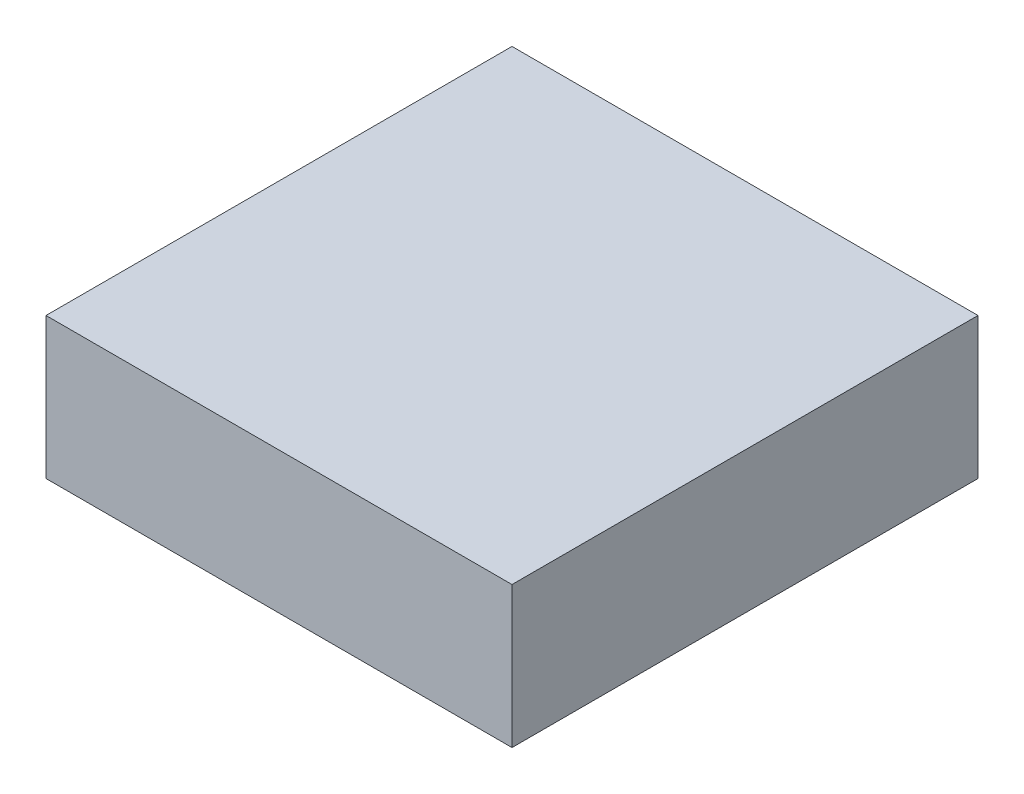
ISO-10303-21;
HEADER;
FILE_DESCRIPTION(('STEP AP214'),'2;1');
FILE_NAME('part.step','',(''),(''),'','','');
FILE_SCHEMA(('AUTOMOTIVE_DESIGN { 1 0 10303 214 1 1 1 1 }'));
ENDSEC;
DATA;
#1=APPLICATION_CONTEXT('core data for automotive mechanical design processes');
#2=APPLICATION_PROTOCOL_DEFINITION('international standard','automotive_design',2000,#1);
#3=PRODUCT_CONTEXT('',#1,'mechanical');
#4=PRODUCT('Part','Part','',(#3));
#5=PRODUCT_RELATED_PRODUCT_CATEGORY('part','',(#4));
#6=PRODUCT_DEFINITION_FORMATION('','',#4);
#7=PRODUCT_DEFINITION_CONTEXT('part definition',#1,'design');
#8=PRODUCT_DEFINITION('design','',#6,#7);
#9=PRODUCT_DEFINITION_SHAPE('','',#8);
#10=(LENGTH_UNIT() NAMED_UNIT(*) SI_UNIT(.MILLI.,.METRE.));
#11=(NAMED_UNIT(*) PLANE_ANGLE_UNIT() SI_UNIT($,.RADIAN.));
#12=(NAMED_UNIT(*) SI_UNIT($,.STERADIAN.) SOLID_ANGLE_UNIT());
#13=UNCERTAINTY_MEASURE_WITH_UNIT(LENGTH_MEASURE(1.E-05),#10,'distance_accuracy_value','');
#14=(GEOMETRIC_REPRESENTATION_CONTEXT(3) GLOBAL_UNCERTAINTY_ASSIGNED_CONTEXT((#13)) GLOBAL_UNIT_ASSIGNED_CONTEXT((#10,
#11,#12)) REPRESENTATION_CONTEXT('',''));
#15=CARTESIAN_POINT('',(0.,0.,0.));
#16=DIRECTION('',(0.,0.,1.));
#17=DIRECTION('',(1.,0.,0.));
#18=AXIS2_PLACEMENT_3D('',#15,#16,#17);
#19=CARTESIAN_POINT('',(27.35,-1.85,-11.525));
#20=DIRECTION('',(0.,-1.,0.));
#21=DIRECTION('',(1.,0.,0.));
#22=AXIS2_PLACEMENT_3D('',#19,#20,#21);
#23=PLANE('',#22);
#24=DIRECTION('',(1.,0.,0.));
#25=VECTOR('',#24,1.);
#26=CARTESIAN_POINT('',(29.,-1.85,-8.225));
#27=LINE('',#26,#25);
#28=CARTESIAN_POINT('',(27.35,-1.85,-8.225));
#29=VERTEX_POINT('',#28);
#30=CARTESIAN_POINT('',(30.65,-1.85,-8.225));
#31=VERTEX_POINT('',#30);
#32=EDGE_CURVE('E54',#29,#31,#27,.T.);
#33=ORIENTED_EDGE('',*,*,#32,.F.);
#34=DIRECTION('',(0.,0.,1.));
#35=VECTOR('',#34,1.);
#36=CARTESIAN_POINT('',(27.35,-1.85,-9.875));
#37=LINE('',#36,#35);
#38=CARTESIAN_POINT('',(27.35,-1.85,-11.525));
#39=VERTEX_POINT('',#38);
#40=EDGE_CURVE('E69',#39,#29,#37,.T.);
#41=ORIENTED_EDGE('',*,*,#40,.F.);
#42=DIRECTION('',(-1.,0.,0.));
#43=VECTOR('',#42,1.);
#44=CARTESIAN_POINT('',(29.,-1.85,-11.525));
#45=LINE('',#44,#43);
#46=CARTESIAN_POINT('',(30.65,-1.85,-11.525));
#47=VERTEX_POINT('',#46);
#48=EDGE_CURVE('E21',#47,#39,#45,.T.);
#49=ORIENTED_EDGE('',*,*,#48,.F.);
#50=DIRECTION('',(0.,0.,-1.));
#51=VECTOR('',#50,1.);
#52=CARTESIAN_POINT('',(30.65,-1.85,-9.875));
#53=LINE('',#52,#51);
#54=EDGE_CURVE('E59',#31,#47,#53,.T.);
#55=ORIENTED_EDGE('',*,*,#54,.F.);
#56=EDGE_LOOP('',(#33,#41,#49,#55));
#57=FACE_BOUND('',#56,.T.);
#58=ADVANCED_FACE('F17',(#57),#23,.T.);
#59=CARTESIAN_POINT('',(27.35,-0.85,-11.525));
#60=DIRECTION('',(0.,0.,-1.));
#61=DIRECTION('',(1.,0.,0.));
#62=AXIS2_PLACEMENT_3D('',#59,#60,#61);
#63=PLANE('',#62);
#64=ORIENTED_EDGE('',*,*,#48,.T.);
#65=DIRECTION('',(0.,-1.,0.));
#66=VECTOR('',#65,1.);
#67=CARTESIAN_POINT('',(27.35,-1.35,-11.525));
#68=LINE('',#67,#66);
#69=CARTESIAN_POINT('',(27.35,-0.85,-11.525));
#70=VERTEX_POINT('',#69);
#71=EDGE_CURVE('E80',#70,#39,#68,.T.);
#72=ORIENTED_EDGE('',*,*,#71,.F.);
#73=DIRECTION('',(1.,0.,0.));
#74=VECTOR('',#73,1.);
#75=CARTESIAN_POINT('',(29.,-0.85,-11.525));
#76=LINE('',#75,#74);
#77=CARTESIAN_POINT('',(30.65,-0.85,-11.525));
#78=VERTEX_POINT('',#77);
#79=EDGE_CURVE('E75',#70,#78,#76,.T.);
#80=ORIENTED_EDGE('',*,*,#79,.T.);
#81=DIRECTION('',(0.,1.,0.));
#82=VECTOR('',#81,1.);
#83=CARTESIAN_POINT('',(30.65,-1.35,-11.525));
#84=LINE('',#83,#82);
#85=EDGE_CURVE('E64',#47,#78,#84,.T.);
#86=ORIENTED_EDGE('',*,*,#85,.F.);
#87=EDGE_LOOP('',(#64,#72,#80,#86));
#88=FACE_BOUND('',#87,.T.);
#89=ADVANCED_FACE('F74',(#88),#63,.T.);
#90=CARTESIAN_POINT('',(30.65,-0.85,-11.525));
#91=DIRECTION('',(1.,0.,0.));
#92=DIRECTION('',(0.,0.,1.));
#93=AXIS2_PLACEMENT_3D('',#90,#91,#92);
#94=PLANE('',#93);
#95=ORIENTED_EDGE('',*,*,#54,.T.);
#96=ORIENTED_EDGE('',*,*,#85,.T.);
#97=DIRECTION('',(0.,0.,1.));
#98=VECTOR('',#97,1.);
#99=CARTESIAN_POINT('',(30.65,-0.85,-9.875));
#100=LINE('',#99,#98);
#101=CARTESIAN_POINT('',(30.65,-0.85,-8.225));
#102=VERTEX_POINT('',#101);
#103=EDGE_CURVE('E85',#78,#102,#100,.T.);
#104=ORIENTED_EDGE('',*,*,#103,.T.);
#105=DIRECTION('',(0.,1.,0.));
#106=VECTOR('',#105,1.);
#107=CARTESIAN_POINT('',(30.65,-1.35,-8.225));
#108=LINE('',#107,#106);
#109=EDGE_CURVE('E66',#31,#102,#108,.T.);
#110=ORIENTED_EDGE('',*,*,#109,.F.);
#111=EDGE_LOOP('',(#95,#96,#104,#110));
#112=FACE_BOUND('',#111,.T.);
#113=ADVANCED_FACE('F61',(#112),#94,.T.);
#114=CARTESIAN_POINT('',(30.65,-0.85,-8.225));
#115=DIRECTION('',(0.,0.,1.));
#116=DIRECTION('',(-1.,0.,0.));
#117=AXIS2_PLACEMENT_3D('',#114,#115,#116);
#118=PLANE('',#117);
#119=ORIENTED_EDGE('',*,*,#32,.T.);
#120=ORIENTED_EDGE('',*,*,#109,.T.);
#121=DIRECTION('',(-1.,0.,0.));
#122=VECTOR('',#121,1.);
#123=CARTESIAN_POINT('',(29.,-0.85,-8.225));
#124=LINE('',#123,#122);
#125=CARTESIAN_POINT('',(27.35,-0.85,-8.225));
#126=VERTEX_POINT('',#125);
#127=EDGE_CURVE('E27',#102,#126,#124,.T.);
#128=ORIENTED_EDGE('',*,*,#127,.T.);
#129=DIRECTION('',(0.,1.,0.));
#130=VECTOR('',#129,1.);
#131=CARTESIAN_POINT('',(27.35,-1.35,-8.225));
#132=LINE('',#131,#130);
#133=EDGE_CURVE('E35',#29,#126,#132,.T.);
#134=ORIENTED_EDGE('',*,*,#133,.F.);
#135=EDGE_LOOP('',(#119,#120,#128,#134));
#136=FACE_BOUND('',#135,.T.);
#137=ADVANCED_FACE('F89',(#136),#118,.T.);
#138=CARTESIAN_POINT('',(27.35,-0.85,-8.225));
#139=DIRECTION('',(-1.,0.,0.));
#140=DIRECTION('',(0.,0.,-1.));
#141=AXIS2_PLACEMENT_3D('',#138,#139,#140);
#142=PLANE('',#141);
#143=ORIENTED_EDGE('',*,*,#40,.T.);
#144=ORIENTED_EDGE('',*,*,#133,.T.);
#145=DIRECTION('',(0.,0.,-1.));
#146=VECTOR('',#145,1.);
#147=CARTESIAN_POINT('',(27.35,-0.85,-9.875));
#148=LINE('',#147,#146);
#149=EDGE_CURVE('E11',#126,#70,#148,.T.);
#150=ORIENTED_EDGE('',*,*,#149,.T.);
#151=ORIENTED_EDGE('',*,*,#71,.T.);
#152=EDGE_LOOP('',(#143,#144,#150,#151));
#153=FACE_BOUND('',#152,.T.);
#154=ADVANCED_FACE('F91',(#153),#142,.T.);
#155=CARTESIAN_POINT('',(27.35,-0.85,-11.525));
#156=DIRECTION('',(0.,-1.,0.));
#157=DIRECTION('',(1.,0.,0.));
#158=AXIS2_PLACEMENT_3D('',#155,#156,#157);
#159=PLANE('',#158);
#160=ORIENTED_EDGE('',*,*,#127,.F.);
#161=ORIENTED_EDGE('',*,*,#103,.F.);
#162=ORIENTED_EDGE('',*,*,#79,.F.);
#163=ORIENTED_EDGE('',*,*,#149,.F.);
#164=EDGE_LOOP('',(#160,#161,#162,#163));
#165=FACE_BOUND('',#164,.T.);
#166=ADVANCED_FACE('F19',(#165),#159,.F.);
#167=CLOSED_SHELL('',(#58,#89,#113,#137,#154,#166));
#168=MANIFOLD_SOLID_BREP('B1',#167);
#169=ADVANCED_BREP_SHAPE_REPRESENTATION('',(#18,#168),#14);
#170=SHAPE_DEFINITION_REPRESENTATION(#9,#169);
ENDSEC;
END-ISO-10303-21;
